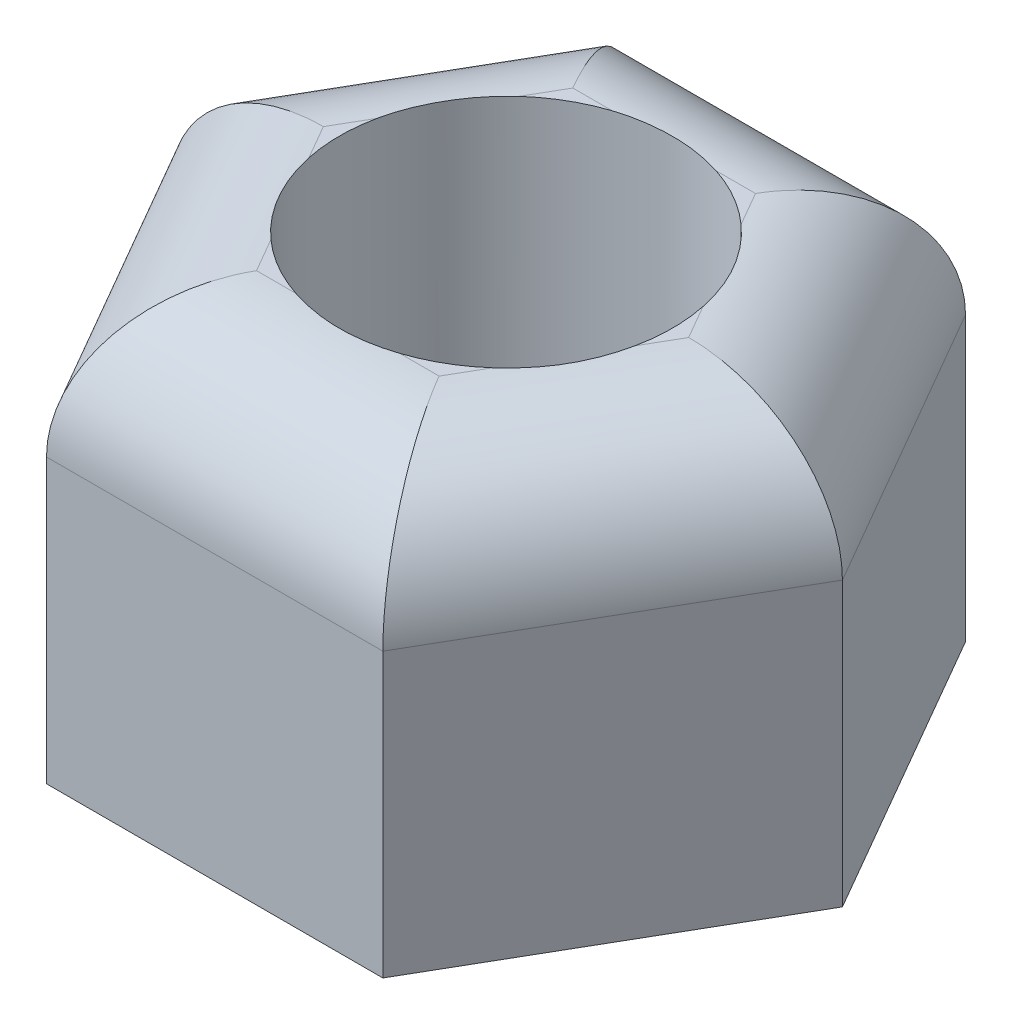
ISO-10303-21;
HEADER;
FILE_DESCRIPTION(('STEP AP214'),'2;1');
FILE_NAME('part.step','',(''),(''),'','','');
FILE_SCHEMA(('AUTOMOTIVE_DESIGN { 1 0 10303 214 1 1 1 1 }'));
ENDSEC;
DATA;
#1=APPLICATION_CONTEXT('core data for automotive mechanical design processes');
#2=APPLICATION_PROTOCOL_DEFINITION('international standard','automotive_design',2000,#1);
#3=PRODUCT_CONTEXT('',#1,'mechanical');
#4=PRODUCT('Part','Part','',(#3));
#5=PRODUCT_RELATED_PRODUCT_CATEGORY('part','',(#4));
#6=PRODUCT_DEFINITION_FORMATION('','',#4);
#7=PRODUCT_DEFINITION_CONTEXT('part definition',#1,'design');
#8=PRODUCT_DEFINITION('design','',#6,#7);
#9=PRODUCT_DEFINITION_SHAPE('','',#8);
#10=(LENGTH_UNIT() NAMED_UNIT(*) SI_UNIT(.MILLI.,.METRE.));
#11=(NAMED_UNIT(*) PLANE_ANGLE_UNIT() SI_UNIT($,.RADIAN.));
#12=(NAMED_UNIT(*) SI_UNIT($,.STERADIAN.) SOLID_ANGLE_UNIT());
#13=UNCERTAINTY_MEASURE_WITH_UNIT(LENGTH_MEASURE(1.E-05),#10,'distance_accuracy_value','');
#14=(GEOMETRIC_REPRESENTATION_CONTEXT(3) GLOBAL_UNCERTAINTY_ASSIGNED_CONTEXT((#13)) GLOBAL_UNIT_ASSIGNED_CONTEXT((#10,
#11,#12)) REPRESENTATION_CONTEXT('',''));
#15=CARTESIAN_POINT('',(0.,0.,0.));
#16=DIRECTION('',(0.,0.,1.));
#17=DIRECTION('',(1.,0.,0.));
#18=AXIS2_PLACEMENT_3D('',#15,#16,#17);
#19=CARTESIAN_POINT('',(0.,7.9375,0.));
#20=DIRECTION('',(0.,1.,0.));
#21=DIRECTION('',(0.,0.,1.));
#22=AXIS2_PLACEMENT_3D('',#19,#20,#21);
#23=PLANE('',#22);
#24=DIRECTION('',(1.,0.,0.));
#25=VECTOR('',#24,1.);
#26=CARTESIAN_POINT('',(3.20790243318486,7.9375,3.01625));
#27=LINE('',#26,#25);
#28=CARTESIAN_POINT('',(0.991393432245753,7.9375,3.01625));
#29=VERTEX_POINT('',#28);
#30=CARTESIAN_POINT('',(1.74143274944321,7.9375,3.01625));
#31=VERTEX_POINT('',#30);
#32=EDGE_CURVE('E211',#29,#31,#27,.T.);
#33=ORIENTED_EDGE('',*,*,#32,.T.);
#34=DIRECTION('',(0.5,0.,-0.866025403784439));
#35=VECTOR('',#34,1.);
#36=CARTESIAN_POINT('',(4.21610034075724,7.9375,-1.27));
#37=LINE('',#36,#35);
#38=CARTESIAN_POINT('',(2.11645240804194,7.9375,2.36669689746986));
#39=VERTEX_POINT('',#38);
#40=EDGE_CURVE('E213',#31,#39,#37,.T.);
#41=ORIENTED_EDGE('',*,*,#40,.T.);
#42=CARTESIAN_POINT('',(0.,7.9375,0.));
#43=DIRECTION('',(0.,1.,0.));
#44=DIRECTION('',(0.,0.,1.));
#45=AXIS2_PLACEMENT_3D('',#42,#43,#44);
#46=CIRCLE('',#45,3.175);
#47=EDGE_CURVE('E166',#29,#39,#46,.T.);
#48=ORIENTED_EDGE('',*,*,#47,.F.);
#49=EDGE_LOOP('',(#33,#41,#48));
#50=FACE_BOUND('',#49,.T.);
#51=ADVANCED_FACE('F33',(#50),#23,.T.);
#52=DIRECTION('',(0.5,0.,0.866025403784439));
#53=VECTOR('',#52,1.);
#54=CARTESIAN_POINT('',(-1.00819790757238,7.9375,4.28625));
#55=LINE('',#54,#53);
#56=CARTESIAN_POINT('',(-2.11645240804194,7.9375,2.36669689746986));
#57=VERTEX_POINT('',#56);
#58=CARTESIAN_POINT('',(-1.74143274944321,7.9375,3.01625));
#59=VERTEX_POINT('',#58);
#60=EDGE_CURVE('E207',#57,#59,#55,.T.);
#61=ORIENTED_EDGE('',*,*,#60,.T.);
#62=DIRECTION('',(1.,0.,0.));
#63=VECTOR('',#62,1.);
#64=CARTESIAN_POINT('',(3.20790243318486,7.9375,3.01625));
#65=LINE('',#64,#63);
#66=CARTESIAN_POINT('',(-0.991393432245749,7.9375,3.01625));
#67=VERTEX_POINT('',#66);
#68=EDGE_CURVE('E209',#59,#67,#65,.T.);
#69=ORIENTED_EDGE('',*,*,#68,.T.);
#70=EDGE_CURVE('E171',#57,#67,#46,.T.);
#71=ORIENTED_EDGE('',*,*,#70,.F.);
#72=EDGE_LOOP('',(#61,#69,#71));
#73=FACE_BOUND('',#72,.T.);
#74=ADVANCED_FACE('F328',(#73),#23,.T.);
#75=DIRECTION('',(-0.5,0.,0.866025403784439));
#76=VECTOR('',#75,1.);
#77=CARTESIAN_POINT('',(-4.21610034075724,7.9375,1.27));
#78=LINE('',#77,#76);
#79=CARTESIAN_POINT('',(-3.10784584028769,7.9375,-0.649553102530141));
#80=VERTEX_POINT('',#79);
#81=CARTESIAN_POINT('',(-3.48286549888642,7.9375,0.));
#82=VERTEX_POINT('',#81);
#83=EDGE_CURVE('E203',#80,#82,#78,.T.);
#84=ORIENTED_EDGE('',*,*,#83,.T.);
#85=DIRECTION('',(0.5,0.,0.866025403784439));
#86=VECTOR('',#85,1.);
#87=CARTESIAN_POINT('',(-1.00819790757238,7.9375,4.28625));
#88=LINE('',#87,#86);
#89=CARTESIAN_POINT('',(-3.10784584028769,7.9375,0.649553102530137));
#90=VERTEX_POINT('',#89);
#91=EDGE_CURVE('E205',#82,#90,#88,.T.);
#92=ORIENTED_EDGE('',*,*,#91,.T.);
#93=EDGE_CURVE('E293',#80,#90,#46,.T.);
#94=ORIENTED_EDGE('',*,*,#93,.F.);
#95=EDGE_LOOP('',(#84,#92,#94));
#96=FACE_BOUND('',#95,.T.);
#97=ADVANCED_FACE('F347',(#96),#23,.T.);
#98=DIRECTION('',(-1.,0.,0.));
#99=VECTOR('',#98,1.);
#100=CARTESIAN_POINT('',(-3.20790243318486,7.9375,-3.01625));
#101=LINE('',#100,#99);
#102=CARTESIAN_POINT('',(-0.991393432245747,7.9375,-3.01625));
#103=VERTEX_POINT('',#102);
#104=CARTESIAN_POINT('',(-1.74143274944321,7.9375,-3.01625));
#105=VERTEX_POINT('',#104);
#106=EDGE_CURVE('E199',#103,#105,#101,.T.);
#107=ORIENTED_EDGE('',*,*,#106,.T.);
#108=DIRECTION('',(-0.5,0.,0.866025403784439));
#109=VECTOR('',#108,1.);
#110=CARTESIAN_POINT('',(-4.21610034075724,7.9375,1.27));
#111=LINE('',#110,#109);
#112=CARTESIAN_POINT('',(-2.11645240804194,7.9375,-2.36669689746986));
#113=VERTEX_POINT('',#112);
#114=EDGE_CURVE('E201',#105,#113,#111,.T.);
#115=ORIENTED_EDGE('',*,*,#114,.T.);
#116=EDGE_CURVE('E298',#103,#113,#46,.T.);
#117=ORIENTED_EDGE('',*,*,#116,.F.);
#118=EDGE_LOOP('',(#107,#115,#117));
#119=FACE_BOUND('',#118,.T.);
#120=ADVANCED_FACE('F342',(#119),#23,.T.);
#121=CARTESIAN_POINT('',(3.10784584028769,7.9375,0.64955310253014));
#122=VERTEX_POINT('',#121);
#123=CARTESIAN_POINT('',(3.10784584028768,7.9375,-0.649553102530146));
#124=VERTEX_POINT('',#123);
#125=EDGE_CURVE('E169',#122,#124,#46,.T.);
#126=ORIENTED_EDGE('',*,*,#125,.F.);
#127=DIRECTION('',(0.5,0.,-0.866025403784439));
#128=VECTOR('',#127,1.);
#129=CARTESIAN_POINT('',(4.21610034075724,7.9375,-1.27));
#130=LINE('',#129,#128);
#131=CARTESIAN_POINT('',(3.48286549888642,7.9375,0.));
#132=VERTEX_POINT('',#131);
#133=EDGE_CURVE('E197',#122,#132,#130,.T.);
#134=ORIENTED_EDGE('',*,*,#133,.T.);
#135=DIRECTION('',(-0.5,0.,-0.866025403784439));
#136=VECTOR('',#135,1.);
#137=CARTESIAN_POINT('',(1.00819790757238,7.9375,-4.28625));
#138=LINE('',#137,#136);
#139=EDGE_CURVE('E195',#132,#124,#138,.T.);
#140=ORIENTED_EDGE('',*,*,#139,.T.);
#141=EDGE_LOOP('',(#126,#134,#140));
#142=FACE_BOUND('',#141,.T.);
#143=ADVANCED_FACE('F340',(#142),#23,.T.);
#144=DIRECTION('',(-0.5,0.,-0.866025403784439));
#145=VECTOR('',#144,1.);
#146=CARTESIAN_POINT('',(1.00819790757238,7.9375,-4.28625));
#147=LINE('',#146,#145);
#148=CARTESIAN_POINT('',(2.11645240804195,7.9375,-2.36669689746986));
#149=VERTEX_POINT('',#148);
#150=CARTESIAN_POINT('',(1.74143274944321,7.9375,-3.01625));
#151=VERTEX_POINT('',#150);
#152=EDGE_CURVE('E150',#149,#151,#147,.T.);
#153=ORIENTED_EDGE('',*,*,#152,.T.);
#154=DIRECTION('',(-1.,0.,0.));
#155=VECTOR('',#154,1.);
#156=CARTESIAN_POINT('',(-3.20790243318486,7.9375,-3.01625));
#157=LINE('',#156,#155);
#158=CARTESIAN_POINT('',(0.991393432245743,7.9375,-3.01625));
#159=VERTEX_POINT('',#158);
#160=EDGE_CURVE('E193',#151,#159,#157,.T.);
#161=ORIENTED_EDGE('',*,*,#160,.T.);
#162=EDGE_CURVE('E302',#149,#159,#46,.T.);
#163=ORIENTED_EDGE('',*,*,#162,.F.);
#164=EDGE_LOOP('',(#153,#161,#163));
#165=FACE_BOUND('',#164,.T.);
#166=ADVANCED_FACE('F321',(#165),#23,.T.);
#167=CARTESIAN_POINT('',(0.,0.,0.));
#168=DIRECTION('',(0.,1.,0.));
#169=DIRECTION('',(0.,0.,1.));
#170=AXIS2_PLACEMENT_3D('',#167,#168,#169);
#171=PLANE('',#170);
#172=DIRECTION('',(-0.5,0.,0.866025403784439));
#173=VECTOR('',#172,1.);
#174=CARTESIAN_POINT('',(-3.20790243318486,0.,-5.55625));
#175=LINE('',#174,#173);
#176=CARTESIAN_POINT('',(-3.20790243318486,0.,-5.55625));
#177=VERTEX_POINT('',#176);
#178=CARTESIAN_POINT('',(-6.41580486636972,0.,0.));
#179=VERTEX_POINT('',#178);
#180=EDGE_CURVE('E158',#177,#179,#175,.T.);
#181=ORIENTED_EDGE('',*,*,#180,.F.);
#182=DIRECTION('',(-1.,0.,0.));
#183=VECTOR('',#182,1.);
#184=CARTESIAN_POINT('',(3.20790243318486,0.,-5.55625));
#185=LINE('',#184,#183);
#186=CARTESIAN_POINT('',(3.20790243318486,0.,-5.55625));
#187=VERTEX_POINT('',#186);
#188=EDGE_CURVE('E182',#187,#177,#185,.T.);
#189=ORIENTED_EDGE('',*,*,#188,.F.);
#190=DIRECTION('',(-0.5,0.,-0.866025403784438));
#191=VECTOR('',#190,1.);
#192=CARTESIAN_POINT('',(6.41580486636972,0.,0.));
#193=LINE('',#192,#191);
#194=CARTESIAN_POINT('',(6.41580486636972,0.,0.));
#195=VERTEX_POINT('',#194);
#196=EDGE_CURVE('E179',#195,#187,#193,.T.);
#197=ORIENTED_EDGE('',*,*,#196,.F.);
#198=DIRECTION('',(0.5,0.,-0.866025403784439));
#199=VECTOR('',#198,1.);
#200=CARTESIAN_POINT('',(3.20790243318486,0.,5.55625));
#201=LINE('',#200,#199);
#202=CARTESIAN_POINT('',(3.20790243318486,0.,5.55625));
#203=VERTEX_POINT('',#202);
#204=EDGE_CURVE('E176',#203,#195,#201,.T.);
#205=ORIENTED_EDGE('',*,*,#204,.F.);
#206=DIRECTION('',(1.,0.,0.));
#207=VECTOR('',#206,1.);
#208=CARTESIAN_POINT('',(-3.20790243318486,0.,5.55625));
#209=LINE('',#208,#207);
#210=CARTESIAN_POINT('',(-3.20790243318486,0.,5.55625));
#211=VERTEX_POINT('',#210);
#212=EDGE_CURVE('E161',#211,#203,#209,.T.);
#213=ORIENTED_EDGE('',*,*,#212,.F.);
#214=DIRECTION('',(0.5,0.,0.866025403784439));
#215=VECTOR('',#214,1.);
#216=CARTESIAN_POINT('',(-6.41580486636972,0.,0.));
#217=LINE('',#216,#215);
#218=EDGE_CURVE('E145',#179,#211,#217,.T.);
#219=ORIENTED_EDGE('',*,*,#218,.F.);
#220=EDGE_LOOP('',(#181,#189,#197,#205,#213,#219));
#221=FACE_BOUND('',#220,.T.);
#222=CARTESIAN_POINT('',(0.,0.,0.));
#223=DIRECTION('',(0.,1.,0.));
#224=DIRECTION('',(0.,0.,1.));
#225=AXIS2_PLACEMENT_3D('',#222,#223,#224);
#226=CIRCLE('',#225,3.175);
#227=CARTESIAN_POINT('',(0.,0.,3.175));
#228=VERTEX_POINT('',#227);
#229=EDGE_CURVE('E173',#228,#228,#226,.T.);
#230=ORIENTED_EDGE('',*,*,#229,.T.);
#231=EDGE_LOOP('',(#230));
#232=FACE_BOUND('',#231,.T.);
#233=ADVANCED_FACE('F155',(#221,#232),#171,.F.);
#234=CARTESIAN_POINT('',(-3.20790243318486,7.9375,-5.55625));
#235=DIRECTION('',(0.866025403784439,0.,0.5));
#236=DIRECTION('',(0.5,0.,-0.866025403784439));
#237=AXIS2_PLACEMENT_3D('',#234,#235,#236);
#238=PLANE('',#237);
#239=DIRECTION('',(0.,-1.,0.));
#240=VECTOR('',#239,1.);
#241=CARTESIAN_POINT('',(-6.41580486636972,7.9375,0.));
#242=LINE('',#241,#240);
#243=CARTESIAN_POINT('',(-6.41580486636972,5.3975,0.));
#244=VERTEX_POINT('',#243);
#245=EDGE_CURVE('E141',#244,#179,#242,.T.);
#246=ORIENTED_EDGE('',*,*,#245,.F.);
#247=DIRECTION('',(-0.5,0.,0.866025403784439));
#248=VECTOR('',#247,1.);
#249=CARTESIAN_POINT('',(-3.20790243318486,5.3975,-5.55625));
#250=LINE('',#249,#248);
#251=CARTESIAN_POINT('',(-3.20790243318486,5.3975,-5.55625));
#252=VERTEX_POINT('',#251);
#253=EDGE_CURVE('E58',#244,#252,#250,.F.);
#254=ORIENTED_EDGE('',*,*,#253,.T.);
#255=DIRECTION('',(0.,-1.,0.));
#256=VECTOR('',#255,1.);
#257=CARTESIAN_POINT('',(-3.20790243318486,7.9375,-5.55625));
#258=LINE('',#257,#256);
#259=EDGE_CURVE('E164',#252,#177,#258,.T.);
#260=ORIENTED_EDGE('',*,*,#259,.T.);
#261=ORIENTED_EDGE('',*,*,#180,.T.);
#262=EDGE_LOOP('',(#246,#254,#260,#261));
#263=FACE_BOUND('',#262,.T.);
#264=ADVANCED_FACE('F163',(#263),#238,.F.);
#265=CARTESIAN_POINT('',(-6.41580486636972,7.9375,0.));
#266=DIRECTION('',(0.866025403784438,0.,-0.5));
#267=DIRECTION('',(-0.5,0.,-0.866025403784439));
#268=AXIS2_PLACEMENT_3D('',#265,#266,#267);
#269=PLANE('',#268);
#270=DIRECTION('',(0.,-1.,0.));
#271=VECTOR('',#270,1.);
#272=CARTESIAN_POINT('',(-3.20790243318486,7.9375,5.55625));
#273=LINE('',#272,#271);
#274=CARTESIAN_POINT('',(-3.20790243318486,5.3975,5.55625));
#275=VERTEX_POINT('',#274);
#276=EDGE_CURVE('E151',#275,#211,#273,.T.);
#277=ORIENTED_EDGE('',*,*,#276,.F.);
#278=DIRECTION('',(0.5,0.,0.866025403784439));
#279=VECTOR('',#278,1.);
#280=CARTESIAN_POINT('',(-6.41580486636972,5.3975,0.));
#281=LINE('',#280,#279);
#282=EDGE_CURVE('E148',#275,#244,#281,.F.);
#283=ORIENTED_EDGE('',*,*,#282,.T.);
#284=ORIENTED_EDGE('',*,*,#245,.T.);
#285=ORIENTED_EDGE('',*,*,#218,.T.);
#286=EDGE_LOOP('',(#277,#283,#284,#285));
#287=FACE_BOUND('',#286,.T.);
#288=ADVANCED_FACE('F144',(#287),#269,.F.);
#289=CARTESIAN_POINT('',(-3.20790243318486,7.9375,5.55625));
#290=DIRECTION('',(0.,0.,-1.));
#291=DIRECTION('',(-1.,0.,0.));
#292=AXIS2_PLACEMENT_3D('',#289,#290,#291);
#293=PLANE('',#292);
#294=DIRECTION('',(0.,-1.,0.));
#295=VECTOR('',#294,1.);
#296=CARTESIAN_POINT('',(3.20790243318486,7.9375,5.55625));
#297=LINE('',#296,#295);
#298=CARTESIAN_POINT('',(3.20790243318486,5.3975,5.55625));
#299=VERTEX_POINT('',#298);
#300=EDGE_CURVE('E189',#299,#203,#297,.T.);
#301=ORIENTED_EDGE('',*,*,#300,.F.);
#302=DIRECTION('',(1.,0.,0.));
#303=VECTOR('',#302,1.);
#304=CARTESIAN_POINT('',(-3.20790243318486,5.3975,5.55625));
#305=LINE('',#304,#303);
#306=EDGE_CURVE('E266',#299,#275,#305,.F.);
#307=ORIENTED_EDGE('',*,*,#306,.T.);
#308=ORIENTED_EDGE('',*,*,#276,.T.);
#309=ORIENTED_EDGE('',*,*,#212,.T.);
#310=EDGE_LOOP('',(#301,#307,#308,#309));
#311=FACE_BOUND('',#310,.T.);
#312=ADVANCED_FACE('F383',(#311),#293,.F.);
#313=CARTESIAN_POINT('',(3.20790243318486,7.9375,5.55625));
#314=DIRECTION('',(-0.866025403784439,0.,-0.5));
#315=DIRECTION('',(-0.5,0.,0.866025403784439));
#316=AXIS2_PLACEMENT_3D('',#313,#314,#315);
#317=PLANE('',#316);
#318=DIRECTION('',(0.,-1.,0.));
#319=VECTOR('',#318,1.);
#320=CARTESIAN_POINT('',(6.41580486636972,7.9375,0.));
#321=LINE('',#320,#319);
#322=CARTESIAN_POINT('',(6.41580486636972,5.3975,0.));
#323=VERTEX_POINT('',#322);
#324=EDGE_CURVE('E187',#323,#195,#321,.T.);
#325=ORIENTED_EDGE('',*,*,#324,.F.);
#326=DIRECTION('',(0.5,0.,-0.866025403784439));
#327=VECTOR('',#326,1.);
#328=CARTESIAN_POINT('',(3.20790243318486,5.3975,5.55625));
#329=LINE('',#328,#327);
#330=EDGE_CURVE('E263',#323,#299,#329,.F.);
#331=ORIENTED_EDGE('',*,*,#330,.T.);
#332=ORIENTED_EDGE('',*,*,#300,.T.);
#333=ORIENTED_EDGE('',*,*,#204,.T.);
#334=EDGE_LOOP('',(#325,#331,#332,#333));
#335=FACE_BOUND('',#334,.T.);
#336=ADVANCED_FACE('F377',(#335),#317,.F.);
#337=CARTESIAN_POINT('',(6.41580486636972,7.9375,0.));
#338=DIRECTION('',(-0.866025403784438,0.,0.5));
#339=DIRECTION('',(0.5,0.,0.866025403784439));
#340=AXIS2_PLACEMENT_3D('',#337,#338,#339);
#341=PLANE('',#340);
#342=DIRECTION('',(0.,-1.,0.));
#343=VECTOR('',#342,1.);
#344=CARTESIAN_POINT('',(3.20790243318486,7.9375,-5.55625));
#345=LINE('',#344,#343);
#346=CARTESIAN_POINT('',(3.20790243318486,5.3975,-5.55625));
#347=VERTEX_POINT('',#346);
#348=EDGE_CURVE('E185',#347,#187,#345,.T.);
#349=ORIENTED_EDGE('',*,*,#348,.F.);
#350=DIRECTION('',(-0.5,0.,-0.866025403784439));
#351=VECTOR('',#350,1.);
#352=CARTESIAN_POINT('',(6.41580486636972,5.3975,0.));
#353=LINE('',#352,#351);
#354=EDGE_CURVE('E11',#347,#323,#353,.F.);
#355=ORIENTED_EDGE('',*,*,#354,.T.);
#356=ORIENTED_EDGE('',*,*,#324,.T.);
#357=ORIENTED_EDGE('',*,*,#196,.T.);
#358=EDGE_LOOP('',(#349,#355,#356,#357));
#359=FACE_BOUND('',#358,.T.);
#360=ADVANCED_FACE('F372',(#359),#341,.F.);
#361=CARTESIAN_POINT('',(3.20790243318486,7.9375,-5.55625));
#362=DIRECTION('',(0.,0.,1.));
#363=DIRECTION('',(1.,0.,0.));
#364=AXIS2_PLACEMENT_3D('',#361,#362,#363);
#365=PLANE('',#364);
#366=ORIENTED_EDGE('',*,*,#259,.F.);
#367=DIRECTION('',(-1.,0.,0.));
#368=VECTOR('',#367,1.);
#369=CARTESIAN_POINT('',(3.20790243318486,5.3975,-5.55625));
#370=LINE('',#369,#368);
#371=EDGE_CURVE('E43',#252,#347,#370,.F.);
#372=ORIENTED_EDGE('',*,*,#371,.T.);
#373=ORIENTED_EDGE('',*,*,#348,.T.);
#374=ORIENTED_EDGE('',*,*,#188,.T.);
#375=EDGE_LOOP('',(#366,#372,#373,#374));
#376=FACE_BOUND('',#375,.T.);
#377=ADVANCED_FACE('F368',(#376),#365,.F.);
#378=CARTESIAN_POINT('',(0.,7.9375,0.));
#379=DIRECTION('',(0.,-1.,0.));
#380=DIRECTION('',(0.,0.,-1.));
#381=AXIS2_PLACEMENT_3D('',#378,#379,#380);
#382=CYLINDRICAL_SURFACE('',#381,3.175);
#383=ORIENTED_EDGE('',*,*,#47,.T.);
#384=CARTESIAN_POINT('',(2.11645240804194,7.9375,2.36669689746986));
#385=CARTESIAN_POINT('',(2.1838450722571,7.93746664417208,2.30644367891749));
#386=CARTESIAN_POINT('',(2.24864896293543,7.93702760948729,2.24329937026613));
#387=CARTESIAN_POINT('',(2.37264152892674,7.93584033864175,2.11171775814883));
#388=CARTESIAN_POINT('',(2.43183003666973,7.93509209325732,2.04328029683922));
#389=CARTESIAN_POINT('',(2.54268822648969,7.9338055841479,1.90344914860591));
#390=CARTESIAN_POINT('',(2.59451352160526,7.93326236151179,1.8321787854641));
#391=CARTESIAN_POINT('',(2.69205827597507,7.93259217771282,1.68558451382471));
#392=CARTESIAN_POINT('',(2.73777862003421,7.93246515616602,1.61026119495645));
#393=CARTESIAN_POINT('',(2.81790820500468,7.93266751233552,1.46495360394042));
#394=CARTESIAN_POINT('',(2.85301359718622,7.9329460700294,1.39535188426539));
#395=CARTESIAN_POINT('',(2.91801004882262,7.93377485867781,1.25375854703218));
#396=CARTESIAN_POINT('',(2.94790134037325,7.93432507753568,1.18176703602091));
#397=CARTESIAN_POINT('',(3.00295075700905,7.93551084193892,1.03405393738644));
#398=CARTESIAN_POINT('',(3.02798024246449,7.93614809753093,0.958284400908539));
#399=CARTESIAN_POINT('',(3.07227303462901,7.9371327440953,0.805067508868558));
#400=CARTESIAN_POINT('',(3.09153568856417,7.93748010226079,0.727619964428341));
#401=CARTESIAN_POINT('',(3.10784584028768,7.9375,0.64955310253014));
#402=B_SPLINE_CURVE_WITH_KNOTS('',3,(#384,#385,#386,#387,#388,#389,#390,#391,#392,#393,#394,
#395,#396,#397,#398,#399,#400,#401),.UNSPECIFIED.,.F.,.F.,(4,2,2,2,2,2,2,2,4),(0.,
0.271115270078406,0.542238628029108,0.806304533460485,1.07033212556294,1.30398791190281,
1.53763329484452,1.77680368299977,2.0160011337132),.UNSPECIFIED.);
#403=EDGE_CURVE('E254',#39,#122,#402,.T.);
#404=ORIENTED_EDGE('',*,*,#403,.T.);
#405=ORIENTED_EDGE('',*,*,#125,.T.);
#406=CARTESIAN_POINT('',(3.10784584028768,7.9375,-0.649553102530146));
#407=CARTESIAN_POINT('',(3.08936135446914,7.93746664417207,-0.738043471045368));
#408=CARTESIAN_POINT('',(3.06707872441181,7.93702760948729,-0.825737440962554));
#409=CARTESIAN_POINT('',(3.01512198864298,7.93584033864175,-0.998908959050091));
#410=CARTESIAN_POINT('',(2.98544766244984,7.93509209325732,-1.08438644102242));
#411=CARTESIAN_POINT('',(2.91977943074942,7.9338055841479,-1.25030802374072));
#412=CARTESIAN_POINT('',(2.88397013328946,7.93326236151179,-1.33082522744033));
#413=CARTESIAN_POINT('',(2.80578814718538,7.93259217771282,-1.48859859855019));
#414=CARTESIAN_POINT('',(2.76341641157768,7.93246515616602,-1.5658552374093));
#415=CARTESIAN_POINT('',(2.67764113888032,7.93266751233552,-1.70790328909645));
#416=CARTESIAN_POINT('',(2.63491697758542,7.9329460700294,-1.773106310373));
#417=CARTESIAN_POINT('',(2.54479177635304,7.93377485867781,-1.90019155726257));
#418=CARTESIAN_POINT('',(2.49739094473577,7.93432507753568,-1.96207393060298));
#419=CARTESIAN_POINT('',(2.39699235716451,7.93551084193892,-2.08360467319033));
#420=CARTESIAN_POINT('',(2.3438887564694,7.93614809753093,-2.14316561167734));
#421=CARTESIAN_POINT('',(2.23334543175613,7.9371327440953,-2.25813274091635));
#422=CARTESIAN_POINT('',(2.17590521777776,7.93748010226079,-2.31353846078861));
#423=CARTESIAN_POINT('',(2.11645240804195,7.9375,-2.36669689746986));
#424=B_SPLINE_CURVE_WITH_KNOTS('',3,(#406,#407,#408,#409,#410,#411,#412,#413,#414,#415,#416,
#417,#418,#419,#420,#421,#422,#423),.UNSPECIFIED.,.F.,.F.,(4,2,2,2,2,2,2,2,4),(0.,
0.271115270078406,0.542238628029108,0.806304533460485,1.07033212556294,1.3039879119028,
1.53763329484452,1.77680368299976,2.01600113371319),.UNSPECIFIED.);
#425=EDGE_CURVE('E216',#124,#149,#424,.T.);
#426=ORIENTED_EDGE('',*,*,#425,.T.);
#427=ORIENTED_EDGE('',*,*,#162,.T.);
#428=CARTESIAN_POINT('',(0.991393432245743,7.9375,-3.01625));
#429=CARTESIAN_POINT('',(0.905516282212041,7.93746664417207,-3.04448714996286));
#430=CARTESIAN_POINT('',(0.818429761476388,7.93702760948729,-3.06903681122868));
#431=CARTESIAN_POINT('',(0.642480459716245,7.93584033864175,-3.11062671719892));
#432=CARTESIAN_POINT('',(0.553617625780113,7.93509209325732,-3.12766673786164));
#433=CARTESIAN_POINT('',(0.37709120425974,7.9338055841479,-3.15375717234663));
#434=CARTESIAN_POINT('',(0.289456611684204,7.93326236151179,-3.16300401290443));
#435=CARTESIAN_POINT('',(0.113729871210312,7.93259217771282,-3.17418311237491));
#436=CARTESIAN_POINT('',(0.0256377915434754,7.93246515616602,-3.17611643236576));
#437=CARTESIAN_POINT('',(-0.140267066124364,7.93266751233552,-3.17285689303688));
#438=CARTESIAN_POINT('',(-0.218096619600798,7.9329460700294,-3.16845819463838));
#439=CARTESIAN_POINT('',(-0.373218272469574,7.93377485867781,-3.15395010429475));
#440=CARTESIAN_POINT('',(-0.450510395637479,7.93432507753568,-3.14384096662388));
#441=CARTESIAN_POINT('',(-0.605958399844547,7.93551084193892,-3.11765861057677));
#442=CARTESIAN_POINT('',(-0.684091485995102,7.93614809753093,-3.10145001258589));
#443=CARTESIAN_POINT('',(-0.838927602872886,7.9371327440953,-3.06320024978491));
#444=CARTESIAN_POINT('',(-0.915630470786415,7.93748010226079,-3.04115842521696));
#445=CARTESIAN_POINT('',(-0.991393432245747,7.9375,-3.01625));
#446=B_SPLINE_CURVE_WITH_KNOTS('',3,(#428,#429,#430,#431,#432,#433,#434,#435,#436,#437,#438,
#439,#440,#441,#442,#443,#444,#445),.UNSPECIFIED.,.F.,.F.,(4,2,2,2,2,2,2,2,4),(0.,
0.271115270078406,0.542238628029108,0.806304533460485,1.07033212556294,1.30398791190281,
1.53763329484452,1.77680368299977,2.01600113371321),.UNSPECIFIED.);
#447=EDGE_CURVE('E223',#159,#103,#446,.T.);
#448=ORIENTED_EDGE('',*,*,#447,.T.);
#449=ORIENTED_EDGE('',*,*,#116,.T.);
#450=CARTESIAN_POINT('',(-2.11645240804194,7.9375,-2.36669689746986));
#451=CARTESIAN_POINT('',(-2.1838450722571,7.93746664417207,-2.30644367891749));
#452=CARTESIAN_POINT('',(-2.24864896293543,7.93702760948729,-2.24329937026613));
#453=CARTESIAN_POINT('',(-2.37264152892673,7.93584033864175,-2.11171775814883));
#454=CARTESIAN_POINT('',(-2.43183003666973,7.93509209325732,-2.04328029683922));
#455=CARTESIAN_POINT('',(-2.54268822648969,7.9338055841479,-1.90344914860591));
#456=CARTESIAN_POINT('',(-2.59451352160526,7.93326236151179,-1.8321787854641));
#457=CARTESIAN_POINT('',(-2.69205827597507,7.93259217771282,-1.68558451382471));
#458=CARTESIAN_POINT('',(-2.73777862003421,7.93246515616602,-1.61026119495646));
#459=CARTESIAN_POINT('',(-2.81790820500468,7.93266751233552,-1.46495360394043));
#460=CARTESIAN_POINT('',(-2.85301359718622,7.9329460700294,-1.39535188426539));
#461=CARTESIAN_POINT('',(-2.91801004882262,7.93377485867781,-1.25375854703218));
#462=CARTESIAN_POINT('',(-2.94790134037325,7.93432507753568,-1.18176703602091));
#463=CARTESIAN_POINT('',(-3.00295075700905,7.93551084193892,-1.03405393738644));
#464=CARTESIAN_POINT('',(-3.02798024246449,7.93614809753093,-0.95828440090854));
#465=CARTESIAN_POINT('',(-3.07227303462901,7.9371327440953,-0.805067508868558));
#466=CARTESIAN_POINT('',(-3.09153568856417,7.93748010226079,-0.727619964428342));
#467=CARTESIAN_POINT('',(-3.10784584028768,7.9375,-0.649553102530141));
#468=B_SPLINE_CURVE_WITH_KNOTS('',3,(#450,#451,#452,#453,#454,#455,#456,#457,#458,#459,#460,
#461,#462,#463,#464,#465,#466,#467),.UNSPECIFIED.,.F.,.F.,(4,2,2,2,2,2,2,2,4),(0.,
0.271115270078406,0.542238628029108,0.806304533460484,1.07033212556294,1.30398791190281,
1.53763329484452,1.77680368299977,2.0160011337132),.UNSPECIFIED.);
#469=EDGE_CURVE('E322',#113,#80,#468,.T.);
#470=ORIENTED_EDGE('',*,*,#469,.T.);
#471=ORIENTED_EDGE('',*,*,#93,.T.);
#472=CARTESIAN_POINT('',(-3.10784584028769,7.9375,0.649553102530138));
#473=CARTESIAN_POINT('',(-3.08936135446914,7.93746664417207,0.73804347104536));
#474=CARTESIAN_POINT('',(-3.06707872441182,7.93702760948729,0.825737440962545));
#475=CARTESIAN_POINT('',(-3.01512198864298,7.93584033864175,0.998908959050083));
#476=CARTESIAN_POINT('',(-2.98544766244984,7.93509209325732,1.08438644102241));
#477=CARTESIAN_POINT('',(-2.91977943074943,7.9338055841479,1.25030802374071));
#478=CARTESIAN_POINT('',(-2.88397013328946,7.93326236151179,1.33082522744032));
#479=CARTESIAN_POINT('',(-2.80578814718538,7.93259217771282,1.48859859855019));
#480=CARTESIAN_POINT('',(-2.76341641157768,7.93246515616602,1.5658552374093));
#481=CARTESIAN_POINT('',(-2.67764113888032,7.93266751233552,1.70790328909645));
#482=CARTESIAN_POINT('',(-2.63491697758542,7.9329460700294,1.77310631037299));
#483=CARTESIAN_POINT('',(-2.54479177635304,7.93377485867781,1.90019155726257));
#484=CARTESIAN_POINT('',(-2.49739094473577,7.93432507753568,1.96207393060297));
#485=CARTESIAN_POINT('',(-2.39699235716451,7.93551084193892,2.08360467319033));
#486=CARTESIAN_POINT('',(-2.34388875646939,7.93614809753093,2.14316561167735));
#487=CARTESIAN_POINT('',(-2.23334543175613,7.9371327440953,2.25813274091636));
#488=CARTESIAN_POINT('',(-2.17590521777776,7.93748010226079,2.31353846078862));
#489=CARTESIAN_POINT('',(-2.11645240804194,7.9375,2.36669689746986));
#490=B_SPLINE_CURVE_WITH_KNOTS('',3,(#472,#473,#474,#475,#476,#477,#478,#479,#480,#481,#482,
#483,#484,#485,#486,#487,#488,#489),.UNSPECIFIED.,.F.,.F.,(4,2,2,2,2,2,2,2,4),(0.,
0.271115270078406,0.542238628029108,0.806304533460485,1.07033212556294,1.30398791190281,
1.53763329484452,1.77680368299977,2.01600113371321),.UNSPECIFIED.);
#491=EDGE_CURVE('E255',#90,#57,#490,.T.);
#492=ORIENTED_EDGE('',*,*,#491,.T.);
#493=ORIENTED_EDGE('',*,*,#70,.T.);
#494=CARTESIAN_POINT('',(-0.991393432245749,7.9375,3.01625));
#495=CARTESIAN_POINT('',(-0.905516282212046,7.93746664417207,3.04448714996286));
#496=CARTESIAN_POINT('',(-0.818429761476393,7.93702760948729,3.06903681122867));
#497=CARTESIAN_POINT('',(-0.642480459716251,7.93584033864175,3.11062671719892));
#498=CARTESIAN_POINT('',(-0.553617625780118,7.93509209325732,3.12766673786164));
#499=CARTESIAN_POINT('',(-0.377091204259745,7.9338055841479,3.15375717234662));
#500=CARTESIAN_POINT('',(-0.28945661168421,7.93326236151179,3.16300401290443));
#501=CARTESIAN_POINT('',(-0.113729871210318,7.93259217771282,3.17418311237491));
#502=CARTESIAN_POINT('',(-0.0256377915434806,7.93246515616602,3.17611643236576));
#503=CARTESIAN_POINT('',(0.140267066124359,7.93266751233552,3.17285689303688));
#504=CARTESIAN_POINT('',(0.218096619600795,7.9329460700294,3.16845819463838));
#505=CARTESIAN_POINT('',(0.373218272469573,7.93377485867781,3.15395010429475));
#506=CARTESIAN_POINT('',(0.450510395637478,7.93432507753568,3.14384096662388));
#507=CARTESIAN_POINT('',(0.605958399844548,7.93551084193892,3.11765861057677));
#508=CARTESIAN_POINT('',(0.684091485995104,7.93614809753093,3.10145001258589));
#509=CARTESIAN_POINT('',(0.83892760287289,7.9371327440953,3.06320024978491));
#510=CARTESIAN_POINT('',(0.91563047078642,7.93748010226079,3.04115842521696));
#511=CARTESIAN_POINT('',(0.991393432245753,7.9375,3.01625));
#512=B_SPLINE_CURVE_WITH_KNOTS('',3,(#494,#495,#496,#497,#498,#499,#500,#501,#502,#503,#504,
#505,#506,#507,#508,#509,#510,#511),.UNSPECIFIED.,.F.,.F.,(4,2,2,2,2,2,2,2,4),(0.,
0.271115270078407,0.542238628029108,0.806304533460485,1.07033212556294,1.30398791190281,
1.53763329484453,1.77680368299978,2.01600113371322),.UNSPECIFIED.);
#513=EDGE_CURVE('E248',#67,#29,#512,.T.);
#514=ORIENTED_EDGE('',*,*,#513,.T.);
#515=EDGE_LOOP('',(#383,#404,#405,#426,#427,#448,#449,#470,#471,#492,#493,#514));
#516=FACE_BOUND('',#515,.T.);
#517=ORIENTED_EDGE('',*,*,#229,.F.);
#518=EDGE_LOOP('',(#517));
#519=FACE_BOUND('',#518,.T.);
#520=ADVANCED_FACE('F229',(#516,#519),#382,.F.);
#521=CARTESIAN_POINT('',(-2.61214912416481,5.3975,-1.508125));
#522=DIRECTION('',(0.5,0.,-0.866025403784439));
#523=DIRECTION('',(-0.866025403784439,0.,-0.5));
#524=AXIS2_PLACEMENT_3D('',#521,#522,#523);
#525=CYLINDRICAL_SURFACE('',#524,2.54);
#526=CARTESIAN_POINT('',(-1.74143274944321,5.3975,-3.01625));
#527=DIRECTION('',(0.866025403784438,0.,-0.5));
#528=DIRECTION('',(0.5,0.,0.866025403784439));
#529=AXIS2_PLACEMENT_3D('',#526,#527,#528);
#530=ELLIPSE('',#529,2.9329393674833,2.54);
#531=EDGE_CURVE('E281',#252,#105,#530,.T.);
#532=ORIENTED_EDGE('',*,*,#531,.F.);
#533=ORIENTED_EDGE('',*,*,#253,.F.);
#534=CARTESIAN_POINT('',(-3.48286549888642,5.3975,0.));
#535=DIRECTION('',(0.,0.,-1.));
#536=DIRECTION('',(1.,0.,0.));
#537=AXIS2_PLACEMENT_3D('',#534,#535,#536);
#538=ELLIPSE('',#537,2.9329393674833,2.54);
#539=EDGE_CURVE('E38',#82,#244,#538,.F.);
#540=ORIENTED_EDGE('',*,*,#539,.F.);
#541=ORIENTED_EDGE('',*,*,#83,.F.);
#542=ORIENTED_EDGE('',*,*,#469,.F.);
#543=ORIENTED_EDGE('',*,*,#114,.F.);
#544=EDGE_LOOP('',(#532,#533,#540,#541,#542,#543));
#545=FACE_BOUND('',#544,.T.);
#546=ADVANCED_FACE('F35',(#545),#525,.T.);
#547=CARTESIAN_POINT('',(-2.61214912416481,5.3975,1.508125));
#548=DIRECTION('',(-0.5,0.,-0.866025403784439));
#549=DIRECTION('',(-0.866025403784439,0.,0.5));
#550=AXIS2_PLACEMENT_3D('',#547,#548,#549);
#551=CYLINDRICAL_SURFACE('',#550,2.54);
#552=ORIENTED_EDGE('',*,*,#539,.T.);
#553=ORIENTED_EDGE('',*,*,#282,.F.);
#554=CARTESIAN_POINT('',(-1.74143274944321,5.3975,3.01625));
#555=DIRECTION('',(-0.866025403784439,0.,-0.5));
#556=DIRECTION('',(0.5,0.,-0.866025403784439));
#557=AXIS2_PLACEMENT_3D('',#554,#555,#556);
#558=ELLIPSE('',#557,2.9329393674833,2.54);
#559=EDGE_CURVE('E279',#59,#275,#558,.F.);
#560=ORIENTED_EDGE('',*,*,#559,.F.);
#561=ORIENTED_EDGE('',*,*,#60,.F.);
#562=ORIENTED_EDGE('',*,*,#491,.F.);
#563=ORIENTED_EDGE('',*,*,#91,.F.);
#564=EDGE_LOOP('',(#552,#553,#560,#561,#562,#563));
#565=FACE_BOUND('',#564,.T.);
#566=ADVANCED_FACE('F331',(#565),#551,.T.);
#567=CARTESIAN_POINT('',(0.,5.3975,-3.01625));
#568=DIRECTION('',(1.,0.,0.));
#569=DIRECTION('',(0.,0.,-1.));
#570=AXIS2_PLACEMENT_3D('',#567,#568,#569);
#571=CYLINDRICAL_SURFACE('',#570,2.54);
#572=ORIENTED_EDGE('',*,*,#447,.F.);
#573=ORIENTED_EDGE('',*,*,#160,.F.);
#574=CARTESIAN_POINT('',(1.74143274944321,5.3975,-3.01625));
#575=DIRECTION('',(0.866025403784439,0.,0.5));
#576=DIRECTION('',(-0.5,0.,0.866025403784439));
#577=AXIS2_PLACEMENT_3D('',#574,#575,#576);
#578=ELLIPSE('',#577,2.9329393674833,2.54);
#579=EDGE_CURVE('E276',#347,#151,#578,.T.);
#580=ORIENTED_EDGE('',*,*,#579,.F.);
#581=ORIENTED_EDGE('',*,*,#371,.F.);
#582=ORIENTED_EDGE('',*,*,#531,.T.);
#583=ORIENTED_EDGE('',*,*,#106,.F.);
#584=EDGE_LOOP('',(#572,#573,#580,#581,#582,#583));
#585=FACE_BOUND('',#584,.T.);
#586=ADVANCED_FACE('F244',(#585),#571,.T.);
#587=CARTESIAN_POINT('',(0.,5.3975,3.01625));
#588=DIRECTION('',(-1.,0.,0.));
#589=DIRECTION('',(0.,0.,1.));
#590=AXIS2_PLACEMENT_3D('',#587,#588,#589);
#591=CYLINDRICAL_SURFACE('',#590,2.54);
#592=ORIENTED_EDGE('',*,*,#559,.T.);
#593=ORIENTED_EDGE('',*,*,#306,.F.);
#594=CARTESIAN_POINT('',(1.74143274944321,5.3975,3.01625));
#595=DIRECTION('',(-0.866025403784438,0.,0.500000000000001));
#596=DIRECTION('',(-0.500000000000001,0.,-0.866025403784438));
#597=AXIS2_PLACEMENT_3D('',#594,#595,#596);
#598=ELLIPSE('',#597,2.9329393674833,2.54);
#599=EDGE_CURVE('E274',#31,#299,#598,.F.);
#600=ORIENTED_EDGE('',*,*,#599,.F.);
#601=ORIENTED_EDGE('',*,*,#32,.F.);
#602=ORIENTED_EDGE('',*,*,#513,.F.);
#603=ORIENTED_EDGE('',*,*,#68,.F.);
#604=EDGE_LOOP('',(#592,#593,#600,#601,#602,#603));
#605=FACE_BOUND('',#604,.T.);
#606=ADVANCED_FACE('F238',(#605),#591,.T.);
#607=CARTESIAN_POINT('',(2.61214912416481,5.3975,-1.508125));
#608=DIRECTION('',(0.5,0.,0.866025403784439));
#609=DIRECTION('',(0.866025403784438,0.,-0.5));
#610=AXIS2_PLACEMENT_3D('',#607,#608,#609);
#611=CYLINDRICAL_SURFACE('',#610,2.54);
#612=ORIENTED_EDGE('',*,*,#425,.F.);
#613=ORIENTED_EDGE('',*,*,#139,.F.);
#614=CARTESIAN_POINT('',(3.48286549888642,5.3975,0.));
#615=DIRECTION('',(0.,0.,1.));
#616=DIRECTION('',(1.,0.,0.));
#617=AXIS2_PLACEMENT_3D('',#614,#615,#616);
#618=ELLIPSE('',#617,2.9329393674833,2.54);
#619=EDGE_CURVE('E271',#323,#132,#618,.T.);
#620=ORIENTED_EDGE('',*,*,#619,.F.);
#621=ORIENTED_EDGE('',*,*,#354,.F.);
#622=ORIENTED_EDGE('',*,*,#579,.T.);
#623=ORIENTED_EDGE('',*,*,#152,.F.);
#624=EDGE_LOOP('',(#612,#613,#620,#621,#622,#623));
#625=FACE_BOUND('',#624,.T.);
#626=ADVANCED_FACE('F232',(#625),#611,.T.);
#627=CARTESIAN_POINT('',(2.61214912416481,5.3975,1.508125));
#628=DIRECTION('',(-0.5,0.,0.866025403784439));
#629=DIRECTION('',(0.866025403784439,0.,0.5));
#630=AXIS2_PLACEMENT_3D('',#627,#628,#629);
#631=CYLINDRICAL_SURFACE('',#630,2.54);
#632=ORIENTED_EDGE('',*,*,#599,.T.);
#633=ORIENTED_EDGE('',*,*,#330,.F.);
#634=ORIENTED_EDGE('',*,*,#619,.T.);
#635=ORIENTED_EDGE('',*,*,#133,.F.);
#636=ORIENTED_EDGE('',*,*,#403,.F.);
#637=ORIENTED_EDGE('',*,*,#40,.F.);
#638=EDGE_LOOP('',(#632,#633,#634,#635,#636,#637));
#639=FACE_BOUND('',#638,.T.);
#640=ADVANCED_FACE('F237',(#639),#631,.T.);
#641=CLOSED_SHELL('',(#51,#74,#97,#120,#143,#166,#233,#264,#288,#312,#336,#360,#377,#520,#546,
#566,#586,#606,#626,#640));
#642=MANIFOLD_SOLID_BREP('B2',#641);
#643=ADVANCED_BREP_SHAPE_REPRESENTATION('',(#18,#642),#14);
#644=SHAPE_DEFINITION_REPRESENTATION(#9,#643);
ENDSEC;
END-ISO-10303-21;
